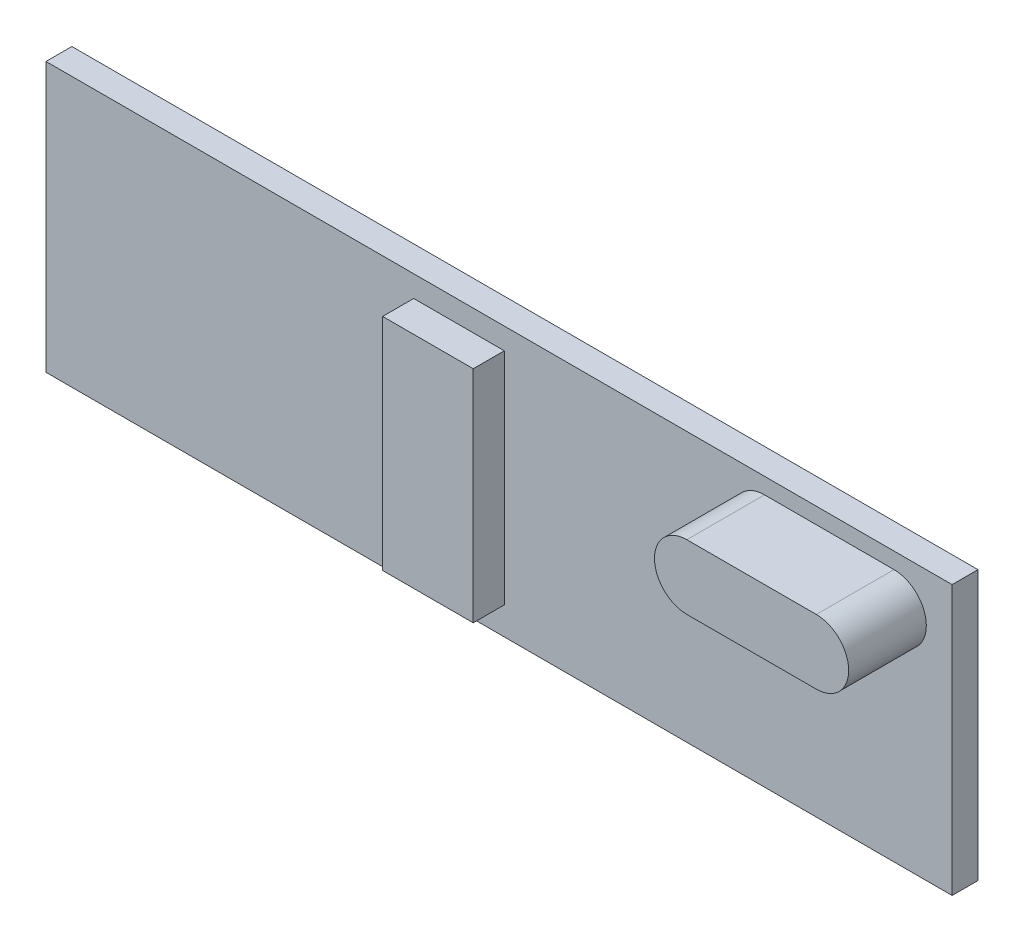
ISO-10303-21;
HEADER;
FILE_DESCRIPTION(('STEP AP214'),'2;1');
FILE_NAME('part.step','',(''),(''),'','','');
FILE_SCHEMA(('AUTOMOTIVE_DESIGN { 1 0 10303 214 1 1 1 1 }'));
ENDSEC;
DATA;
#1=APPLICATION_CONTEXT('core data for automotive mechanical design processes');
#2=APPLICATION_PROTOCOL_DEFINITION('international standard','automotive_design',2000,#1);
#3=PRODUCT_CONTEXT('',#1,'mechanical');
#4=PRODUCT('Part','Part','',(#3));
#5=PRODUCT_RELATED_PRODUCT_CATEGORY('part','',(#4));
#6=PRODUCT_DEFINITION_FORMATION('','',#4);
#7=PRODUCT_DEFINITION_CONTEXT('part definition',#1,'design');
#8=PRODUCT_DEFINITION('design','',#6,#7);
#9=PRODUCT_DEFINITION_SHAPE('','',#8);
#10=(LENGTH_UNIT() NAMED_UNIT(*) SI_UNIT(.MILLI.,.METRE.));
#11=(NAMED_UNIT(*) PLANE_ANGLE_UNIT() SI_UNIT($,.RADIAN.));
#12=(NAMED_UNIT(*) SI_UNIT($,.STERADIAN.) SOLID_ANGLE_UNIT());
#13=UNCERTAINTY_MEASURE_WITH_UNIT(LENGTH_MEASURE(1.E-05),#10,'distance_accuracy_value','');
#14=(GEOMETRIC_REPRESENTATION_CONTEXT(3) GLOBAL_UNCERTAINTY_ASSIGNED_CONTEXT((#13)) GLOBAL_UNIT_ASSIGNED_CONTEXT((#10,
#11,#12)) REPRESENTATION_CONTEXT('',''));
#15=CARTESIAN_POINT('',(0.,0.,0.));
#16=DIRECTION('',(0.,0.,1.));
#17=DIRECTION('',(1.,0.,0.));
#18=AXIS2_PLACEMENT_3D('',#15,#16,#17);
#19=CARTESIAN_POINT('',(0.,0.,1.));
#20=DIRECTION('',(0.,0.,1.));
#21=DIRECTION('',(1.,0.,0.));
#22=AXIS2_PLACEMENT_3D('',#19,#20,#21);
#23=PLANE('',#22);
#24=DIRECTION('',(0.,-1.,0.));
#25=VECTOR('',#24,1.);
#26=CARTESIAN_POINT('',(-17.5,-5.2,1.));
#27=LINE('',#26,#25);
#28=CARTESIAN_POINT('',(-17.5,5.2,1.));
#29=VERTEX_POINT('',#28);
#30=CARTESIAN_POINT('',(-17.5,-5.2,1.));
#31=VERTEX_POINT('',#30);
#32=EDGE_CURVE('E182',#29,#31,#27,.T.);
#33=ORIENTED_EDGE('',*,*,#32,.T.);
#34=DIRECTION('',(1.,0.,0.));
#35=VECTOR('',#34,1.);
#36=CARTESIAN_POINT('',(17.5,-5.2,1.));
#37=LINE('',#36,#35);
#38=CARTESIAN_POINT('',(17.5,-5.2,1.));
#39=VERTEX_POINT('',#38);
#40=EDGE_CURVE('E185',#31,#39,#37,.T.);
#41=ORIENTED_EDGE('',*,*,#40,.T.);
#42=DIRECTION('',(0.,1.,0.));
#43=VECTOR('',#42,1.);
#44=CARTESIAN_POINT('',(17.5,-5.2,1.));
#45=LINE('',#44,#43);
#46=CARTESIAN_POINT('',(17.5,5.2,1.));
#47=VERTEX_POINT('',#46);
#48=EDGE_CURVE('E188',#39,#47,#45,.T.);
#49=ORIENTED_EDGE('',*,*,#48,.T.);
#50=DIRECTION('',(-1.,0.,0.));
#51=VECTOR('',#50,1.);
#52=CARTESIAN_POINT('',(17.5,5.2,1.));
#53=LINE('',#52,#51);
#54=EDGE_CURVE('E190',#47,#29,#53,.T.);
#55=ORIENTED_EDGE('',*,*,#54,.T.);
#56=EDGE_LOOP('',(#33,#41,#49,#55));
#57=FACE_BOUND('',#56,.T.);
#58=DIRECTION('',(-1.,0.,0.));
#59=VECTOR('',#58,1.);
#60=CARTESIAN_POINT('',(15.2539026629936,4.57903255803142,1.));
#61=LINE('',#60,#59);
#62=CARTESIAN_POINT('',(15.2539026629936,4.57903255803142,1.));
#63=VERTEX_POINT('',#62);
#64=CARTESIAN_POINT('',(10.2539026629936,4.57903255803142,1.));
#65=VERTEX_POINT('',#64);
#66=EDGE_CURVE('E56',#63,#65,#61,.T.);
#67=ORIENTED_EDGE('',*,*,#66,.F.);
#68=CARTESIAN_POINT('',(15.2539026629936,3.32903255803142,1.));
#69=DIRECTION('',(0.,0.,1.));
#70=DIRECTION('',(1.,0.,0.));
#71=AXIS2_PLACEMENT_3D('',#68,#69,#70);
#72=CIRCLE('',#71,1.25);
#73=CARTESIAN_POINT('',(15.2539026629936,2.07903255803141,1.));
#74=VERTEX_POINT('',#73);
#75=EDGE_CURVE('E147',#74,#63,#72,.T.);
#76=ORIENTED_EDGE('',*,*,#75,.F.);
#77=DIRECTION('',(-1.,0.,0.));
#78=VECTOR('',#77,1.);
#79=CARTESIAN_POINT('',(15.2539026629936,2.07903255803141,1.));
#80=LINE('',#79,#78);
#81=CARTESIAN_POINT('',(10.2539026629936,2.07903255803141,1.));
#82=VERTEX_POINT('',#81);
#83=EDGE_CURVE('E158',#74,#82,#80,.T.);
#84=ORIENTED_EDGE('',*,*,#83,.T.);
#85=CARTESIAN_POINT('',(10.2539026629936,3.32903255803142,1.));
#86=DIRECTION('',(0.,0.,1.));
#87=DIRECTION('',(1.,0.,0.));
#88=AXIS2_PLACEMENT_3D('',#85,#86,#87);
#89=CIRCLE('',#88,1.25);
#90=EDGE_CURVE('E167',#65,#82,#89,.T.);
#91=ORIENTED_EDGE('',*,*,#90,.F.);
#92=EDGE_LOOP('',(#67,#76,#84,#91));
#93=FACE_BOUND('',#92,.T.);
#94=DIRECTION('',(1.,0.,0.));
#95=VECTOR('',#94,1.);
#96=CARTESIAN_POINT('',(-3.29722158272293,-4.12736939601533,1.));
#97=LINE('',#96,#95);
#98=CARTESIAN_POINT('',(-3.29722158272293,-4.12736939601533,1.));
#99=VERTEX_POINT('',#98);
#100=CARTESIAN_POINT('',(0.202778417277065,-4.12736939601533,1.));
#101=VERTEX_POINT('',#100);
#102=EDGE_CURVE('E371',#99,#101,#97,.T.);
#103=ORIENTED_EDGE('',*,*,#102,.F.);
#104=DIRECTION('',(0.,-1.,0.));
#105=VECTOR('',#104,1.);
#106=CARTESIAN_POINT('',(-3.29722158272294,4.37263060398467,1.));
#107=LINE('',#106,#105);
#108=CARTESIAN_POINT('',(-3.29722158272294,4.37263060398467,1.));
#109=VERTEX_POINT('',#108);
#110=EDGE_CURVE('E145',#109,#99,#107,.T.);
#111=ORIENTED_EDGE('',*,*,#110,.F.);
#112=DIRECTION('',(-1.,0.,0.));
#113=VECTOR('',#112,1.);
#114=CARTESIAN_POINT('',(-3.29722158272294,4.37263060398467,1.));
#115=LINE('',#114,#113);
#116=CARTESIAN_POINT('',(0.202778417277064,4.37263060398467,1.));
#117=VERTEX_POINT('',#116);
#118=EDGE_CURVE('E141',#117,#109,#115,.T.);
#119=ORIENTED_EDGE('',*,*,#118,.F.);
#120=DIRECTION('',(0.,1.,0.));
#121=VECTOR('',#120,1.);
#122=CARTESIAN_POINT('',(0.202778417277064,4.37263060398467,1.));
#123=LINE('',#122,#121);
#124=EDGE_CURVE('E368',#101,#117,#123,.T.);
#125=ORIENTED_EDGE('',*,*,#124,.F.);
#126=EDGE_LOOP('',(#103,#111,#119,#125));
#127=FACE_BOUND('',#126,.T.);
#128=ADVANCED_FACE('F33',(#57,#93,#127),#23,.T.);
#129=CARTESIAN_POINT('',(-17.5,-5.2,1.));
#130=DIRECTION('',(1.,0.,0.));
#131=DIRECTION('',(0.,0.,-1.));
#132=AXIS2_PLACEMENT_3D('',#129,#130,#131);
#133=PLANE('',#132);
#134=DIRECTION('',(0.,-1.,0.));
#135=VECTOR('',#134,1.);
#136=CARTESIAN_POINT('',(-17.5,-5.2,0.));
#137=LINE('',#136,#135);
#138=CARTESIAN_POINT('',(-17.5,5.2,0.));
#139=VERTEX_POINT('',#138);
#140=CARTESIAN_POINT('',(-17.5,-5.2,0.));
#141=VERTEX_POINT('',#140);
#142=EDGE_CURVE('E181',#139,#141,#137,.T.);
#143=ORIENTED_EDGE('',*,*,#142,.T.);
#144=DIRECTION('',(0.,0.,-1.));
#145=VECTOR('',#144,1.);
#146=CARTESIAN_POINT('',(-17.5,-5.2,1.));
#147=LINE('',#146,#145);
#148=EDGE_CURVE('E11',#31,#141,#147,.T.);
#149=ORIENTED_EDGE('',*,*,#148,.F.);
#150=ORIENTED_EDGE('',*,*,#32,.F.);
#151=DIRECTION('',(0.,0.,-1.));
#152=VECTOR('',#151,1.);
#153=CARTESIAN_POINT('',(-17.5,5.2,1.));
#154=LINE('',#153,#152);
#155=EDGE_CURVE('E192',#29,#139,#154,.T.);
#156=ORIENTED_EDGE('',*,*,#155,.T.);
#157=EDGE_LOOP('',(#143,#149,#150,#156));
#158=FACE_BOUND('',#157,.T.);
#159=ADVANCED_FACE('F35',(#158),#133,.F.);
#160=CARTESIAN_POINT('',(17.5,-5.2,1.));
#161=DIRECTION('',(0.,1.,0.));
#162=DIRECTION('',(-1.,0.,0.));
#163=AXIS2_PLACEMENT_3D('',#160,#161,#162);
#164=PLANE('',#163);
#165=DIRECTION('',(1.,0.,0.));
#166=VECTOR('',#165,1.);
#167=CARTESIAN_POINT('',(17.5,-5.2,0.));
#168=LINE('',#167,#166);
#169=CARTESIAN_POINT('',(17.5,-5.2,0.));
#170=VERTEX_POINT('',#169);
#171=EDGE_CURVE('E195',#141,#170,#168,.T.);
#172=ORIENTED_EDGE('',*,*,#171,.T.);
#173=DIRECTION('',(0.,0.,-1.));
#174=VECTOR('',#173,1.);
#175=CARTESIAN_POINT('',(17.5,-5.2,1.));
#176=LINE('',#175,#174);
#177=EDGE_CURVE('E41',#39,#170,#176,.T.);
#178=ORIENTED_EDGE('',*,*,#177,.F.);
#179=ORIENTED_EDGE('',*,*,#40,.F.);
#180=ORIENTED_EDGE('',*,*,#148,.T.);
#181=EDGE_LOOP('',(#172,#178,#179,#180));
#182=FACE_BOUND('',#181,.T.);
#183=ADVANCED_FACE('F224',(#182),#164,.F.);
#184=CARTESIAN_POINT('',(17.5,-5.2,1.));
#185=DIRECTION('',(-1.,0.,0.));
#186=DIRECTION('',(0.,0.,1.));
#187=AXIS2_PLACEMENT_3D('',#184,#185,#186);
#188=PLANE('',#187);
#189=DIRECTION('',(0.,1.,0.));
#190=VECTOR('',#189,1.);
#191=CARTESIAN_POINT('',(17.5,-5.2,0.));
#192=LINE('',#191,#190);
#193=CARTESIAN_POINT('',(17.5,5.2,0.));
#194=VERTEX_POINT('',#193);
#195=EDGE_CURVE('E197',#170,#194,#192,.T.);
#196=ORIENTED_EDGE('',*,*,#195,.T.);
#197=DIRECTION('',(0.,0.,-1.));
#198=VECTOR('',#197,1.);
#199=CARTESIAN_POINT('',(17.5,5.2,1.));
#200=LINE('',#199,#198);
#201=EDGE_CURVE('E202',#47,#194,#200,.T.);
#202=ORIENTED_EDGE('',*,*,#201,.F.);
#203=ORIENTED_EDGE('',*,*,#48,.F.);
#204=ORIENTED_EDGE('',*,*,#177,.T.);
#205=EDGE_LOOP('',(#196,#202,#203,#204));
#206=FACE_BOUND('',#205,.T.);
#207=ADVANCED_FACE('F209',(#206),#188,.F.);
#208=CARTESIAN_POINT('',(17.5,5.2,1.));
#209=DIRECTION('',(0.,-1.,0.));
#210=DIRECTION('',(1.,0.,0.));
#211=AXIS2_PLACEMENT_3D('',#208,#209,#210);
#212=PLANE('',#211);
#213=DIRECTION('',(-1.,0.,0.));
#214=VECTOR('',#213,1.);
#215=CARTESIAN_POINT('',(17.5,5.2,0.));
#216=LINE('',#215,#214);
#217=EDGE_CURVE('E186',#194,#139,#216,.T.);
#218=ORIENTED_EDGE('',*,*,#217,.T.);
#219=ORIENTED_EDGE('',*,*,#155,.F.);
#220=ORIENTED_EDGE('',*,*,#54,.F.);
#221=ORIENTED_EDGE('',*,*,#201,.T.);
#222=EDGE_LOOP('',(#218,#219,#220,#221));
#223=FACE_BOUND('',#222,.T.);
#224=ADVANCED_FACE('F218',(#223),#212,.F.);
#225=CARTESIAN_POINT('',(0.,0.,0.));
#226=DIRECTION('',(0.,0.,1.));
#227=DIRECTION('',(1.,0.,0.));
#228=AXIS2_PLACEMENT_3D('',#225,#226,#227);
#229=PLANE('',#228);
#230=ORIENTED_EDGE('',*,*,#142,.F.);
#231=ORIENTED_EDGE('',*,*,#217,.F.);
#232=ORIENTED_EDGE('',*,*,#195,.F.);
#233=ORIENTED_EDGE('',*,*,#171,.F.);
#234=EDGE_LOOP('',(#230,#231,#232,#233));
#235=FACE_BOUND('',#234,.T.);
#236=ADVANCED_FACE('F215',(#235),#229,.F.);
#237=CARTESIAN_POINT('',(15.2539026629936,3.32903255803142,4.));
#238=DIRECTION('',(0.,0.,-1.));
#239=DIRECTION('',(-1.,0.,0.));
#240=AXIS2_PLACEMENT_3D('',#237,#238,#239);
#241=CYLINDRICAL_SURFACE('',#240,1.25);
#242=ORIENTED_EDGE('',*,*,#75,.T.);
#243=DIRECTION('',(0.,0.,-1.));
#244=VECTOR('',#243,1.);
#245=CARTESIAN_POINT('',(15.2539026629936,4.57903255803142,4.));
#246=LINE('',#245,#244);
#247=CARTESIAN_POINT('',(15.2539026629936,4.57903255803142,4.));
#248=VERTEX_POINT('',#247);
#249=EDGE_CURVE('E179',#248,#63,#246,.T.);
#250=ORIENTED_EDGE('',*,*,#249,.F.);
#251=CARTESIAN_POINT('',(15.2539026629936,3.32903255803142,4.));
#252=DIRECTION('',(0.,0.,1.));
#253=DIRECTION('',(1.,0.,0.));
#254=AXIS2_PLACEMENT_3D('',#251,#252,#253);
#255=CIRCLE('',#254,1.25);
#256=CARTESIAN_POINT('',(15.2539026629936,2.07903255803141,4.));
#257=VERTEX_POINT('',#256);
#258=EDGE_CURVE('E154',#257,#248,#255,.T.);
#259=ORIENTED_EDGE('',*,*,#258,.F.);
#260=DIRECTION('',(0.,0.,-1.));
#261=VECTOR('',#260,1.);
#262=CARTESIAN_POINT('',(15.2539026629936,2.07903255803141,4.));
#263=LINE('',#262,#261);
#264=EDGE_CURVE('E164',#257,#74,#263,.T.);
#265=ORIENTED_EDGE('',*,*,#264,.T.);
#266=EDGE_LOOP('',(#242,#250,#259,#265));
#267=FACE_BOUND('',#266,.T.);
#268=ADVANCED_FACE('F237',(#267),#241,.T.);
#269=CARTESIAN_POINT('',(15.2539026629936,4.57903255803142,4.));
#270=DIRECTION('',(0.,-1.,0.));
#271=DIRECTION('',(0.,0.,-1.));
#272=AXIS2_PLACEMENT_3D('',#269,#270,#271);
#273=PLANE('',#272);
#274=ORIENTED_EDGE('',*,*,#66,.T.);
#275=DIRECTION('',(0.,0.,-1.));
#276=VECTOR('',#275,1.);
#277=CARTESIAN_POINT('',(10.2539026629936,4.57903255803142,4.));
#278=LINE('',#277,#276);
#279=CARTESIAN_POINT('',(10.2539026629936,4.57903255803142,4.));
#280=VERTEX_POINT('',#279);
#281=EDGE_CURVE('E176',#280,#65,#278,.T.);
#282=ORIENTED_EDGE('',*,*,#281,.F.);
#283=DIRECTION('',(-1.,0.,0.));
#284=VECTOR('',#283,1.);
#285=CARTESIAN_POINT('',(15.2539026629936,4.57903255803142,4.));
#286=LINE('',#285,#284);
#287=EDGE_CURVE('E157',#248,#280,#286,.T.);
#288=ORIENTED_EDGE('',*,*,#287,.F.);
#289=ORIENTED_EDGE('',*,*,#249,.T.);
#290=EDGE_LOOP('',(#274,#282,#288,#289));
#291=FACE_BOUND('',#290,.T.);
#292=ADVANCED_FACE('F256',(#291),#273,.F.);
#293=CARTESIAN_POINT('',(10.2539026629936,3.32903255803142,4.));
#294=DIRECTION('',(0.,0.,-1.));
#295=DIRECTION('',(-1.,0.,0.));
#296=AXIS2_PLACEMENT_3D('',#293,#294,#295);
#297=CYLINDRICAL_SURFACE('',#296,1.25);
#298=ORIENTED_EDGE('',*,*,#90,.T.);
#299=DIRECTION('',(0.,0.,-1.));
#300=VECTOR('',#299,1.);
#301=CARTESIAN_POINT('',(10.2539026629936,2.07903255803141,4.));
#302=LINE('',#301,#300);
#303=CARTESIAN_POINT('',(10.2539026629936,2.07903255803141,4.));
#304=VERTEX_POINT('',#303);
#305=EDGE_CURVE('E173',#304,#82,#302,.T.);
#306=ORIENTED_EDGE('',*,*,#305,.F.);
#307=CARTESIAN_POINT('',(10.2539026629936,3.32903255803142,4.));
#308=DIRECTION('',(0.,0.,1.));
#309=DIRECTION('',(1.,0.,0.));
#310=AXIS2_PLACEMENT_3D('',#307,#308,#309);
#311=CIRCLE('',#310,1.25);
#312=EDGE_CURVE('E160',#280,#304,#311,.T.);
#313=ORIENTED_EDGE('',*,*,#312,.F.);
#314=ORIENTED_EDGE('',*,*,#281,.T.);
#315=EDGE_LOOP('',(#298,#306,#313,#314));
#316=FACE_BOUND('',#315,.T.);
#317=ADVANCED_FACE('F263',(#316),#297,.T.);
#318=CARTESIAN_POINT('',(15.2539026629936,2.07903255803141,4.));
#319=DIRECTION('',(0.,-1.,0.));
#320=DIRECTION('',(1.,0.,0.));
#321=AXIS2_PLACEMENT_3D('',#318,#319,#320);
#322=PLANE('',#321);
#323=ORIENTED_EDGE('',*,*,#83,.F.);
#324=ORIENTED_EDGE('',*,*,#264,.F.);
#325=DIRECTION('',(-1.,0.,0.));
#326=VECTOR('',#325,1.);
#327=CARTESIAN_POINT('',(15.2539026629936,2.07903255803141,4.));
#328=LINE('',#327,#326);
#329=EDGE_CURVE('E162',#257,#304,#328,.T.);
#330=ORIENTED_EDGE('',*,*,#329,.T.);
#331=ORIENTED_EDGE('',*,*,#305,.T.);
#332=EDGE_LOOP('',(#323,#324,#330,#331));
#333=FACE_BOUND('',#332,.T.);
#334=ADVANCED_FACE('F270',(#333),#322,.T.);
#335=CARTESIAN_POINT('',(15.2539026629936,3.32903255803142,4.));
#336=DIRECTION('',(0.,0.,1.));
#337=DIRECTION('',(1.,0.,0.));
#338=AXIS2_PLACEMENT_3D('',#335,#336,#337);
#339=PLANE('',#338);
#340=ORIENTED_EDGE('',*,*,#258,.T.);
#341=ORIENTED_EDGE('',*,*,#287,.T.);
#342=ORIENTED_EDGE('',*,*,#312,.T.);
#343=ORIENTED_EDGE('',*,*,#329,.F.);
#344=EDGE_LOOP('',(#340,#341,#342,#343));
#345=FACE_BOUND('',#344,.T.);
#346=ADVANCED_FACE('F278',(#345),#339,.T.);
#347=CARTESIAN_POINT('',(-3.29722158272294,4.37263060398467,2.2));
#348=DIRECTION('',(1.,0.,0.));
#349=DIRECTION('',(0.,1.,0.));
#350=AXIS2_PLACEMENT_3D('',#347,#348,#349);
#351=PLANE('',#350);
#352=ORIENTED_EDGE('',*,*,#110,.T.);
#353=DIRECTION('',(0.,0.,-1.));
#354=VECTOR('',#353,1.);
#355=CARTESIAN_POINT('',(-3.29722158272293,-4.12736939601533,2.2));
#356=LINE('',#355,#354);
#357=CARTESIAN_POINT('',(-3.29722158272293,-4.12736939601533,2.2));
#358=VERTEX_POINT('',#357);
#359=EDGE_CURVE('E126',#358,#99,#356,.T.);
#360=ORIENTED_EDGE('',*,*,#359,.F.);
#361=DIRECTION('',(0.,-1.,0.));
#362=VECTOR('',#361,1.);
#363=CARTESIAN_POINT('',(-3.29722158272294,4.37263060398467,2.2));
#364=LINE('',#363,#362);
#365=CARTESIAN_POINT('',(-3.29722158272294,4.37263060398467,2.2));
#366=VERTEX_POINT('',#365);
#367=EDGE_CURVE('E133',#366,#358,#364,.T.);
#368=ORIENTED_EDGE('',*,*,#367,.F.);
#369=DIRECTION('',(0.,0.,-1.));
#370=VECTOR('',#369,1.);
#371=CARTESIAN_POINT('',(-3.29722158272294,4.37263060398467,2.2));
#372=LINE('',#371,#370);
#373=EDGE_CURVE('E365',#366,#109,#372,.T.);
#374=ORIENTED_EDGE('',*,*,#373,.T.);
#375=EDGE_LOOP('',(#352,#360,#368,#374));
#376=FACE_BOUND('',#375,.T.);
#377=ADVANCED_FACE('F143',(#376),#351,.F.);
#378=CARTESIAN_POINT('',(-3.29722158272293,-4.12736939601533,2.2));
#379=DIRECTION('',(0.,1.,0.));
#380=DIRECTION('',(0.,0.,1.));
#381=AXIS2_PLACEMENT_3D('',#378,#379,#380);
#382=PLANE('',#381);
#383=ORIENTED_EDGE('',*,*,#102,.T.);
#384=DIRECTION('',(0.,0.,-1.));
#385=VECTOR('',#384,1.);
#386=CARTESIAN_POINT('',(0.202778417277065,-4.12736939601533,2.2));
#387=LINE('',#386,#385);
#388=CARTESIAN_POINT('',(0.202778417277065,-4.12736939601533,2.2));
#389=VERTEX_POINT('',#388);
#390=EDGE_CURVE('E129',#389,#101,#387,.T.);
#391=ORIENTED_EDGE('',*,*,#390,.F.);
#392=DIRECTION('',(1.,0.,0.));
#393=VECTOR('',#392,1.);
#394=CARTESIAN_POINT('',(-3.29722158272293,-4.12736939601533,2.2));
#395=LINE('',#394,#393);
#396=EDGE_CURVE('E122',#358,#389,#395,.T.);
#397=ORIENTED_EDGE('',*,*,#396,.F.);
#398=ORIENTED_EDGE('',*,*,#359,.T.);
#399=EDGE_LOOP('',(#383,#391,#397,#398));
#400=FACE_BOUND('',#399,.T.);
#401=ADVANCED_FACE('F124',(#400),#382,.F.);
#402=CARTESIAN_POINT('',(0.202778417277064,4.37263060398467,2.2));
#403=DIRECTION('',(-1.,0.,0.));
#404=DIRECTION('',(0.,-1.,0.));
#405=AXIS2_PLACEMENT_3D('',#402,#403,#404);
#406=PLANE('',#405);
#407=ORIENTED_EDGE('',*,*,#124,.T.);
#408=DIRECTION('',(0.,0.,-1.));
#409=VECTOR('',#408,1.);
#410=CARTESIAN_POINT('',(0.202778417277064,4.37263060398467,2.2));
#411=LINE('',#410,#409);
#412=CARTESIAN_POINT('',(0.202778417277064,4.37263060398467,2.2));
#413=VERTEX_POINT('',#412);
#414=EDGE_CURVE('E48',#413,#117,#411,.T.);
#415=ORIENTED_EDGE('',*,*,#414,.F.);
#416=DIRECTION('',(0.,1.,0.));
#417=VECTOR('',#416,1.);
#418=CARTESIAN_POINT('',(0.202778417277064,4.37263060398467,2.2));
#419=LINE('',#418,#417);
#420=EDGE_CURVE('E132',#389,#413,#419,.T.);
#421=ORIENTED_EDGE('',*,*,#420,.F.);
#422=ORIENTED_EDGE('',*,*,#390,.T.);
#423=EDGE_LOOP('',(#407,#415,#421,#422));
#424=FACE_BOUND('',#423,.T.);
#425=ADVANCED_FACE('F299',(#424),#406,.F.);
#426=CARTESIAN_POINT('',(-3.29722158272294,4.37263060398467,2.2));
#427=DIRECTION('',(0.,-1.,0.));
#428=DIRECTION('',(0.,0.,-1.));
#429=AXIS2_PLACEMENT_3D('',#426,#427,#428);
#430=PLANE('',#429);
#431=ORIENTED_EDGE('',*,*,#118,.T.);
#432=ORIENTED_EDGE('',*,*,#373,.F.);
#433=DIRECTION('',(-1.,0.,0.));
#434=VECTOR('',#433,1.);
#435=CARTESIAN_POINT('',(-3.29722158272294,4.37263060398467,2.2));
#436=LINE('',#435,#434);
#437=EDGE_CURVE('E137',#413,#366,#436,.T.);
#438=ORIENTED_EDGE('',*,*,#437,.F.);
#439=ORIENTED_EDGE('',*,*,#414,.T.);
#440=EDGE_LOOP('',(#431,#432,#438,#439));
#441=FACE_BOUND('',#440,.T.);
#442=ADVANCED_FACE('F306',(#441),#430,.F.);
#443=CARTESIAN_POINT('',(0.,0.,2.2));
#444=DIRECTION('',(0.,0.,1.));
#445=DIRECTION('',(1.,0.,0.));
#446=AXIS2_PLACEMENT_3D('',#443,#444,#445);
#447=PLANE('',#446);
#448=ORIENTED_EDGE('',*,*,#367,.T.);
#449=ORIENTED_EDGE('',*,*,#396,.T.);
#450=ORIENTED_EDGE('',*,*,#420,.T.);
#451=ORIENTED_EDGE('',*,*,#437,.T.);
#452=EDGE_LOOP('',(#448,#449,#450,#451));
#453=FACE_BOUND('',#452,.T.);
#454=ADVANCED_FACE('F136',(#453),#447,.T.);
#455=CLOSED_SHELL('',(#128,#159,#183,#207,#224,#236,#268,#292,#317,#334,#346,#377,#401,#425,
#442,#454));
#456=MANIFOLD_SOLID_BREP('B2',#455);
#457=ADVANCED_BREP_SHAPE_REPRESENTATION('',(#18,#456),#14);
#458=SHAPE_DEFINITION_REPRESENTATION(#9,#457);
ENDSEC;
END-ISO-10303-21;
